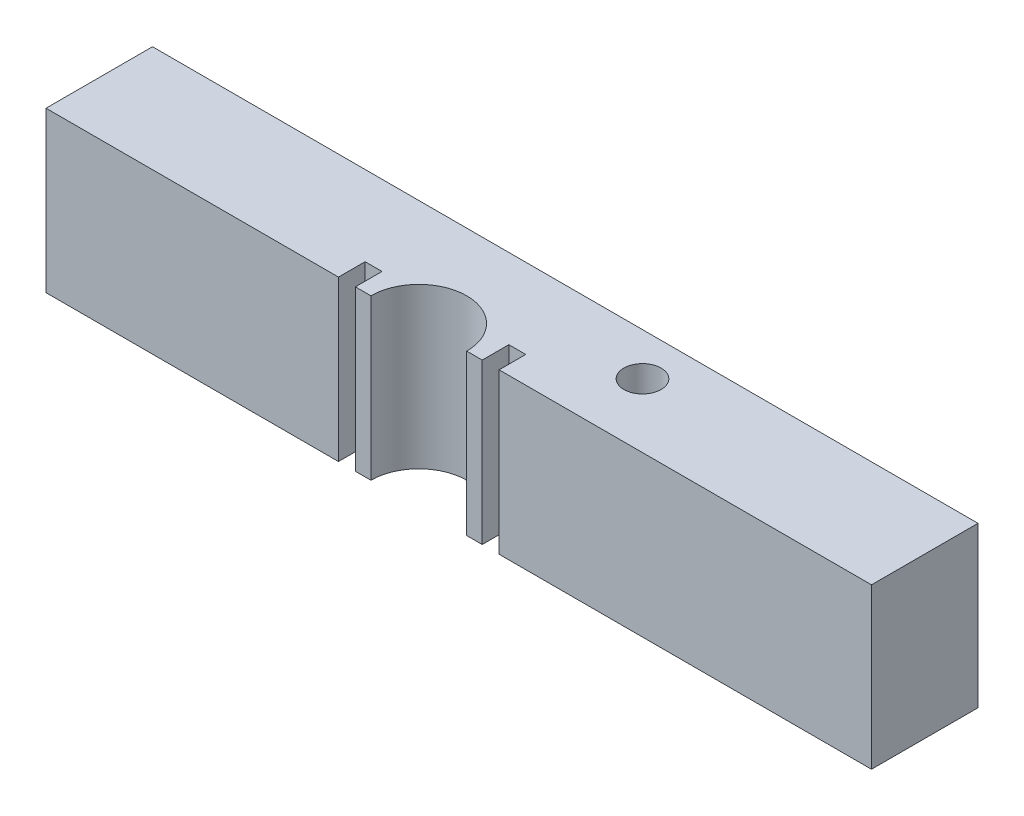
ISO-10303-21;
HEADER;
FILE_DESCRIPTION(('STEP AP214'),'2;1');
FILE_NAME('part.step','',(''),(''),'','','');
FILE_SCHEMA(('AUTOMOTIVE_DESIGN { 1 0 10303 214 1 1 1 1 }'));
ENDSEC;
DATA;
#1=APPLICATION_CONTEXT('core data for automotive mechanical design processes');
#2=APPLICATION_PROTOCOL_DEFINITION('international standard','automotive_design',2000,#1);
#3=PRODUCT_CONTEXT('',#1,'mechanical');
#4=PRODUCT('Part','Part','',(#3));
#5=PRODUCT_RELATED_PRODUCT_CATEGORY('part','',(#4));
#6=PRODUCT_DEFINITION_FORMATION('','',#4);
#7=PRODUCT_DEFINITION_CONTEXT('part definition',#1,'design');
#8=PRODUCT_DEFINITION('design','',#6,#7);
#9=PRODUCT_DEFINITION_SHAPE('','',#8);
#10=(LENGTH_UNIT() NAMED_UNIT(*) SI_UNIT(.MILLI.,.METRE.));
#11=(NAMED_UNIT(*) PLANE_ANGLE_UNIT() SI_UNIT($,.RADIAN.));
#12=(NAMED_UNIT(*) SI_UNIT($,.STERADIAN.) SOLID_ANGLE_UNIT());
#13=UNCERTAINTY_MEASURE_WITH_UNIT(LENGTH_MEASURE(1.E-05),#10,'distance_accuracy_value','');
#14=(GEOMETRIC_REPRESENTATION_CONTEXT(3) GLOBAL_UNCERTAINTY_ASSIGNED_CONTEXT((#13)) GLOBAL_UNIT_ASSIGNED_CONTEXT((#10,
#11,#12)) REPRESENTATION_CONTEXT('',''));
#15=CARTESIAN_POINT('',(0.,0.,0.));
#16=DIRECTION('',(0.,0.,1.));
#17=DIRECTION('',(1.,0.,0.));
#18=AXIS2_PLACEMENT_3D('',#15,#16,#17);
#19=CARTESIAN_POINT('',(0.,30.,0.));
#20=DIRECTION('',(0.,1.,0.));
#21=DIRECTION('',(0.,0.,1.));
#22=AXIS2_PLACEMENT_3D('',#19,#20,#21);
#23=PLANE('',#22);
#24=CARTESIAN_POINT('',(30.,30.,-12.));
#25=DIRECTION('',(0.,-1.,0.));
#26=DIRECTION('',(0.,0.,-1.));
#27=AXIS2_PLACEMENT_3D('',#24,#25,#26);
#28=CIRCLE('',#27,3.5);
#29=CARTESIAN_POINT('',(30.,30.,-15.5));
#30=VERTEX_POINT('',#29);
#31=EDGE_CURVE('E155',#30,#30,#28,.T.);
#32=ORIENTED_EDGE('',*,*,#31,.T.);
#33=EDGE_LOOP('',(#32));
#34=FACE_BOUND('',#33,.T.);
#35=DIRECTION('',(0.,0.,1.));
#36=VECTOR('',#35,1.);
#37=CARTESIAN_POINT('',(-70.,30.,-20.));
#38=LINE('',#37,#36);
#39=CARTESIAN_POINT('',(-70.,30.,-20.));
#40=VERTEX_POINT('',#39);
#41=CARTESIAN_POINT('',(-70.,30.,0.));
#42=VERTEX_POINT('',#41);
#43=EDGE_CURVE('E190',#40,#42,#38,.T.);
#44=ORIENTED_EDGE('',*,*,#43,.T.);
#45=DIRECTION('',(-1.,0.,0.));
#46=VECTOR('',#45,1.);
#47=CARTESIAN_POINT('',(85.,30.,0.));
#48=LINE('',#47,#46);
#49=CARTESIAN_POINT('',(-15.08125,30.,0.));
#50=VERTEX_POINT('',#49);
#51=EDGE_CURVE('E148',#50,#42,#48,.T.);
#52=ORIENTED_EDGE('',*,*,#51,.F.);
#53=DIRECTION('',(0.,0.,1.));
#54=VECTOR('',#53,1.);
#55=CARTESIAN_POINT('',(-15.08125,30.,0.));
#56=LINE('',#55,#54);
#57=CARTESIAN_POINT('',(-15.08125,30.,-5.));
#58=VERTEX_POINT('',#57);
#59=EDGE_CURVE('E244',#58,#50,#56,.T.);
#60=ORIENTED_EDGE('',*,*,#59,.F.);
#61=DIRECTION('',(-1.,0.,0.));
#62=VECTOR('',#61,1.);
#63=CARTESIAN_POINT('',(0.,30.,-4.99999999999999));
#64=LINE('',#63,#62);
#65=CARTESIAN_POINT('',(-11.90625,30.,-5.));
#66=VERTEX_POINT('',#65);
#67=EDGE_CURVE('E236',#66,#58,#64,.T.);
#68=ORIENTED_EDGE('',*,*,#67,.F.);
#69=DIRECTION('',(0.,0.,1.));
#70=VECTOR('',#69,1.);
#71=CARTESIAN_POINT('',(-11.90625,30.,0.));
#72=LINE('',#71,#70);
#73=CARTESIAN_POINT('',(-11.90625,30.,0.));
#74=VERTEX_POINT('',#73);
#75=EDGE_CURVE('E248',#66,#74,#72,.T.);
#76=ORIENTED_EDGE('',*,*,#75,.T.);
#77=CARTESIAN_POINT('',(-8.99999999999999,30.,0.));
#78=VERTEX_POINT('',#77);
#79=EDGE_CURVE('E210',#78,#74,#48,.T.);
#80=ORIENTED_EDGE('',*,*,#79,.F.);
#81=CARTESIAN_POINT('',(0.,30.,0.));
#82=DIRECTION('',(0.,1.,0.));
#83=DIRECTION('',(0.,0.,1.));
#84=AXIS2_PLACEMENT_3D('',#81,#82,#83);
#85=CIRCLE('',#84,9.);
#86=CARTESIAN_POINT('',(8.99999999999999,30.,0.));
#87=VERTEX_POINT('',#86);
#88=EDGE_CURVE('E175',#87,#78,#85,.T.);
#89=ORIENTED_EDGE('',*,*,#88,.F.);
#90=CARTESIAN_POINT('',(11.90625,30.,0.));
#91=VERTEX_POINT('',#90);
#92=EDGE_CURVE('E215',#91,#87,#48,.T.);
#93=ORIENTED_EDGE('',*,*,#92,.F.);
#94=DIRECTION('',(0.,0.,1.));
#95=VECTOR('',#94,1.);
#96=CARTESIAN_POINT('',(11.90625,30.,0.));
#97=LINE('',#96,#95);
#98=CARTESIAN_POINT('',(11.90625,30.,-5.));
#99=VERTEX_POINT('',#98);
#100=EDGE_CURVE('E232',#99,#91,#97,.T.);
#101=ORIENTED_EDGE('',*,*,#100,.F.);
#102=DIRECTION('',(1.,0.,0.));
#103=VECTOR('',#102,1.);
#104=CARTESIAN_POINT('',(0.,30.,-5.00000000000002));
#105=LINE('',#104,#103);
#106=CARTESIAN_POINT('',(15.08125,30.,-5.));
#107=VERTEX_POINT('',#106);
#108=EDGE_CURVE('E266',#99,#107,#105,.T.);
#109=ORIENTED_EDGE('',*,*,#108,.T.);
#110=DIRECTION('',(0.,0.,1.));
#111=VECTOR('',#110,1.);
#112=CARTESIAN_POINT('',(15.08125,30.,0.));
#113=LINE('',#112,#111);
#114=CARTESIAN_POINT('',(15.08125,30.,0.));
#115=VERTEX_POINT('',#114);
#116=EDGE_CURVE('E276',#107,#115,#113,.T.);
#117=ORIENTED_EDGE('',*,*,#116,.T.);
#118=CARTESIAN_POINT('',(85.,30.,0.));
#119=VERTEX_POINT('',#118);
#120=EDGE_CURVE('E65',#119,#115,#48,.T.);
#121=ORIENTED_EDGE('',*,*,#120,.F.);
#122=DIRECTION('',(0.,0.,-1.));
#123=VECTOR('',#122,1.);
#124=CARTESIAN_POINT('',(85.,30.,-20.));
#125=LINE('',#124,#123);
#126=CARTESIAN_POINT('',(85.,30.,-20.));
#127=VERTEX_POINT('',#126);
#128=EDGE_CURVE('E206',#119,#127,#125,.T.);
#129=ORIENTED_EDGE('',*,*,#128,.T.);
#130=DIRECTION('',(-1.,0.,0.));
#131=VECTOR('',#130,1.);
#132=CARTESIAN_POINT('',(-70.,30.,-20.));
#133=LINE('',#132,#131);
#134=EDGE_CURVE('E185',#127,#40,#133,.T.);
#135=ORIENTED_EDGE('',*,*,#134,.T.);
#136=EDGE_LOOP('',(#44,#52,#60,#68,#76,#80,#89,#93,#101,#109,#117,#121,#129,#135));
#137=FACE_BOUND('',#136,.T.);
#138=ADVANCED_FACE('F41',(#34,#137),#23,.T.);
#139=CARTESIAN_POINT('',(0.,0.,0.));
#140=DIRECTION('',(0.,1.,0.));
#141=DIRECTION('',(0.,0.,1.));
#142=AXIS2_PLACEMENT_3D('',#139,#140,#141);
#143=PLANE('',#142);
#144=CARTESIAN_POINT('',(30.,0.,-12.));
#145=DIRECTION('',(0.,-1.,0.));
#146=DIRECTION('',(0.,0.,-1.));
#147=AXIS2_PLACEMENT_3D('',#144,#145,#146);
#148=CIRCLE('',#147,3.5);
#149=CARTESIAN_POINT('',(30.,0.,-15.5));
#150=VERTEX_POINT('',#149);
#151=EDGE_CURVE('E439',#150,#150,#148,.T.);
#152=ORIENTED_EDGE('',*,*,#151,.F.);
#153=EDGE_LOOP('',(#152));
#154=FACE_BOUND('',#153,.T.);
#155=DIRECTION('',(1.,0.,0.));
#156=VECTOR('',#155,1.);
#157=CARTESIAN_POINT('',(-70.,0.,0.));
#158=LINE('',#157,#156);
#159=CARTESIAN_POINT('',(-70.,0.,0.));
#160=VERTEX_POINT('',#159);
#161=CARTESIAN_POINT('',(-15.08125,0.,0.));
#162=VERTEX_POINT('',#161);
#163=EDGE_CURVE('E145',#160,#162,#158,.T.);
#164=ORIENTED_EDGE('',*,*,#163,.F.);
#165=DIRECTION('',(0.,0.,1.));
#166=VECTOR('',#165,1.);
#167=CARTESIAN_POINT('',(-70.,0.,-20.));
#168=LINE('',#167,#166);
#169=CARTESIAN_POINT('',(-70.,0.,-20.));
#170=VERTEX_POINT('',#169);
#171=EDGE_CURVE('E162',#170,#160,#168,.T.);
#172=ORIENTED_EDGE('',*,*,#171,.F.);
#173=DIRECTION('',(-1.,0.,0.));
#174=VECTOR('',#173,1.);
#175=CARTESIAN_POINT('',(-70.,0.,-20.));
#176=LINE('',#175,#174);
#177=CARTESIAN_POINT('',(85.,0.,-20.));
#178=VERTEX_POINT('',#177);
#179=EDGE_CURVE('E179',#178,#170,#176,.T.);
#180=ORIENTED_EDGE('',*,*,#179,.F.);
#181=DIRECTION('',(0.,0.,-1.));
#182=VECTOR('',#181,1.);
#183=CARTESIAN_POINT('',(85.,0.,-20.));
#184=LINE('',#183,#182);
#185=CARTESIAN_POINT('',(85.,0.,0.));
#186=VERTEX_POINT('',#185);
#187=EDGE_CURVE('E174',#186,#178,#184,.T.);
#188=ORIENTED_EDGE('',*,*,#187,.F.);
#189=CARTESIAN_POINT('',(15.08125,0.,0.));
#190=VERTEX_POINT('',#189);
#191=EDGE_CURVE('E154',#190,#186,#158,.T.);
#192=ORIENTED_EDGE('',*,*,#191,.F.);
#193=DIRECTION('',(0.,0.,1.));
#194=VECTOR('',#193,1.);
#195=CARTESIAN_POINT('',(15.08125,0.,0.));
#196=LINE('',#195,#194);
#197=CARTESIAN_POINT('',(15.08125,0.,-5.));
#198=VERTEX_POINT('',#197);
#199=EDGE_CURVE('E265',#198,#190,#196,.T.);
#200=ORIENTED_EDGE('',*,*,#199,.F.);
#201=DIRECTION('',(1.,0.,0.));
#202=VECTOR('',#201,1.);
#203=CARTESIAN_POINT('',(0.,0.,-5.00000000000002));
#204=LINE('',#203,#202);
#205=CARTESIAN_POINT('',(11.90625,0.,-5.));
#206=VERTEX_POINT('',#205);
#207=EDGE_CURVE('E269',#206,#198,#204,.T.);
#208=ORIENTED_EDGE('',*,*,#207,.F.);
#209=DIRECTION('',(0.,0.,1.));
#210=VECTOR('',#209,1.);
#211=CARTESIAN_POINT('',(11.90625,0.,0.));
#212=LINE('',#211,#210);
#213=CARTESIAN_POINT('',(11.90625,0.,0.));
#214=VERTEX_POINT('',#213);
#215=EDGE_CURVE('E261',#206,#214,#212,.T.);
#216=ORIENTED_EDGE('',*,*,#215,.T.);
#217=CARTESIAN_POINT('',(8.99999999999999,0.,0.));
#218=VERTEX_POINT('',#217);
#219=EDGE_CURVE('E57',#218,#214,#158,.T.);
#220=ORIENTED_EDGE('',*,*,#219,.F.);
#221=CARTESIAN_POINT('',(0.,0.,0.));
#222=DIRECTION('',(0.,1.,0.));
#223=DIRECTION('',(0.,0.,1.));
#224=AXIS2_PLACEMENT_3D('',#221,#222,#223);
#225=CIRCLE('',#224,9.);
#226=CARTESIAN_POINT('',(-8.99999999999999,0.,0.));
#227=VERTEX_POINT('',#226);
#228=EDGE_CURVE('E182',#218,#227,#225,.T.);
#229=ORIENTED_EDGE('',*,*,#228,.T.);
#230=CARTESIAN_POINT('',(-11.90625,0.,0.));
#231=VERTEX_POINT('',#230);
#232=EDGE_CURVE('E168',#231,#227,#158,.T.);
#233=ORIENTED_EDGE('',*,*,#232,.F.);
#234=DIRECTION('',(0.,0.,1.));
#235=VECTOR('',#234,1.);
#236=CARTESIAN_POINT('',(-11.90625,0.,0.));
#237=LINE('',#236,#235);
#238=CARTESIAN_POINT('',(-11.90625,0.,-5.));
#239=VERTEX_POINT('',#238);
#240=EDGE_CURVE('E235',#239,#231,#237,.T.);
#241=ORIENTED_EDGE('',*,*,#240,.F.);
#242=DIRECTION('',(-1.,0.,0.));
#243=VECTOR('',#242,1.);
#244=CARTESIAN_POINT('',(0.,0.,-4.99999999999999));
#245=LINE('',#244,#243);
#246=CARTESIAN_POINT('',(-15.08125,0.,-5.));
#247=VERTEX_POINT('',#246);
#248=EDGE_CURVE('E240',#239,#247,#245,.T.);
#249=ORIENTED_EDGE('',*,*,#248,.T.);
#250=DIRECTION('',(0.,0.,1.));
#251=VECTOR('',#250,1.);
#252=CARTESIAN_POINT('',(-15.08125,0.,0.));
#253=LINE('',#252,#251);
#254=EDGE_CURVE('E165',#247,#162,#253,.T.);
#255=ORIENTED_EDGE('',*,*,#254,.T.);
#256=EDGE_LOOP('',(#164,#172,#180,#188,#192,#200,#208,#216,#220,#229,#233,#241,#249,#255));
#257=FACE_BOUND('',#256,.T.);
#258=ADVANCED_FACE('F160',(#154,#257),#143,.F.);
#259=CARTESIAN_POINT('',(-70.,30.,-20.));
#260=DIRECTION('',(1.,0.,0.));
#261=DIRECTION('',(0.,0.,-1.));
#262=AXIS2_PLACEMENT_3D('',#259,#260,#261);
#263=PLANE('',#262);
#264=DIRECTION('',(0.,-1.,0.));
#265=VECTOR('',#264,1.);
#266=CARTESIAN_POINT('',(-70.,30.,0.));
#267=LINE('',#266,#265);
#268=EDGE_CURVE('E142',#42,#160,#267,.T.);
#269=ORIENTED_EDGE('',*,*,#268,.F.);
#270=ORIENTED_EDGE('',*,*,#43,.F.);
#271=DIRECTION('',(0.,-1.,0.));
#272=VECTOR('',#271,1.);
#273=CARTESIAN_POINT('',(-70.,30.,-20.));
#274=LINE('',#273,#272);
#275=EDGE_CURVE('E172',#40,#170,#274,.T.);
#276=ORIENTED_EDGE('',*,*,#275,.T.);
#277=ORIENTED_EDGE('',*,*,#171,.T.);
#278=EDGE_LOOP('',(#269,#270,#276,#277));
#279=FACE_BOUND('',#278,.T.);
#280=ADVANCED_FACE('F43',(#279),#263,.F.);
#281=CARTESIAN_POINT('',(85.,30.,-20.));
#282=DIRECTION('',(-1.,0.,0.));
#283=DIRECTION('',(0.,0.,1.));
#284=AXIS2_PLACEMENT_3D('',#281,#282,#283);
#285=PLANE('',#284);
#286=DIRECTION('',(0.,1.,0.));
#287=VECTOR('',#286,1.);
#288=CARTESIAN_POINT('',(85.,0.,0.));
#289=LINE('',#288,#287);
#290=EDGE_CURVE('E167',#186,#119,#289,.T.);
#291=ORIENTED_EDGE('',*,*,#290,.F.);
#292=ORIENTED_EDGE('',*,*,#187,.T.);
#293=DIRECTION('',(0.,-1.,0.));
#294=VECTOR('',#293,1.);
#295=CARTESIAN_POINT('',(85.,30.,-20.));
#296=LINE('',#295,#294);
#297=EDGE_CURVE('E50',#127,#178,#296,.T.);
#298=ORIENTED_EDGE('',*,*,#297,.F.);
#299=ORIENTED_EDGE('',*,*,#128,.F.);
#300=EDGE_LOOP('',(#291,#292,#298,#299));
#301=FACE_BOUND('',#300,.T.);
#302=ADVANCED_FACE('F205',(#301),#285,.F.);
#303=CARTESIAN_POINT('',(0.,30.,0.));
#304=DIRECTION('',(0.,-1.,0.));
#305=DIRECTION('',(0.,0.,-1.));
#306=AXIS2_PLACEMENT_3D('',#303,#304,#305);
#307=CYLINDRICAL_SURFACE('',#306,9.);
#308=ORIENTED_EDGE('',*,*,#88,.T.);
#309=DIRECTION('',(0.,-1.,0.));
#310=VECTOR('',#309,1.);
#311=CARTESIAN_POINT('',(-9.,30.,0.));
#312=LINE('',#311,#310);
#313=EDGE_CURVE('E228',#78,#227,#312,.T.);
#314=ORIENTED_EDGE('',*,*,#313,.T.);
#315=ORIENTED_EDGE('',*,*,#228,.F.);
#316=DIRECTION('',(0.,-1.,0.));
#317=VECTOR('',#316,1.);
#318=CARTESIAN_POINT('',(9.,30.,0.));
#319=LINE('',#318,#317);
#320=EDGE_CURVE('E224',#218,#87,#319,.F.);
#321=ORIENTED_EDGE('',*,*,#320,.T.);
#322=EDGE_LOOP('',(#308,#314,#315,#321));
#323=FACE_BOUND('',#322,.T.);
#324=ADVANCED_FACE('F332',(#323),#307,.F.);
#325=CARTESIAN_POINT('',(11.90625,0.,0.));
#326=DIRECTION('',(-1.,0.,0.));
#327=DIRECTION('',(0.,0.,1.));
#328=AXIS2_PLACEMENT_3D('',#325,#326,#327);
#329=PLANE('',#328);
#330=DIRECTION('',(0.,1.,0.));
#331=VECTOR('',#330,1.);
#332=CARTESIAN_POINT('',(11.90625,0.,0.));
#333=LINE('',#332,#331);
#334=EDGE_CURVE('E221',#214,#91,#333,.T.);
#335=ORIENTED_EDGE('',*,*,#334,.F.);
#336=ORIENTED_EDGE('',*,*,#215,.F.);
#337=DIRECTION('',(0.,1.,0.));
#338=VECTOR('',#337,1.);
#339=CARTESIAN_POINT('',(11.90625,0.,-5.));
#340=LINE('',#339,#338);
#341=EDGE_CURVE('E249',#206,#99,#340,.T.);
#342=ORIENTED_EDGE('',*,*,#341,.T.);
#343=ORIENTED_EDGE('',*,*,#100,.T.);
#344=EDGE_LOOP('',(#335,#336,#342,#343));
#345=FACE_BOUND('',#344,.T.);
#346=ADVANCED_FACE('F327',(#345),#329,.F.);
#347=CARTESIAN_POINT('',(15.08125,0.,0.));
#348=DIRECTION('',(-1.,0.,0.));
#349=DIRECTION('',(0.,0.,1.));
#350=AXIS2_PLACEMENT_3D('',#347,#348,#349);
#351=PLANE('',#350);
#352=ORIENTED_EDGE('',*,*,#199,.T.);
#353=DIRECTION('',(0.,1.,0.));
#354=VECTOR('',#353,1.);
#355=CARTESIAN_POINT('',(15.08125,0.,0.));
#356=LINE('',#355,#354);
#357=EDGE_CURVE('E218',#190,#115,#356,.T.);
#358=ORIENTED_EDGE('',*,*,#357,.T.);
#359=ORIENTED_EDGE('',*,*,#116,.F.);
#360=DIRECTION('',(0.,1.,0.));
#361=VECTOR('',#360,1.);
#362=CARTESIAN_POINT('',(15.08125,0.,-5.));
#363=LINE('',#362,#361);
#364=EDGE_CURVE('E272',#198,#107,#363,.T.);
#365=ORIENTED_EDGE('',*,*,#364,.F.);
#366=EDGE_LOOP('',(#352,#358,#359,#365));
#367=FACE_BOUND('',#366,.T.);
#368=ADVANCED_FACE('F317',(#367),#351,.T.);
#369=CARTESIAN_POINT('',(-15.08125,0.,0.));
#370=DIRECTION('',(-1.,0.,0.));
#371=DIRECTION('',(0.,0.,1.));
#372=AXIS2_PLACEMENT_3D('',#369,#370,#371);
#373=PLANE('',#372);
#374=DIRECTION('',(0.,1.,0.));
#375=VECTOR('',#374,1.);
#376=CARTESIAN_POINT('',(-15.08125,0.,0.));
#377=LINE('',#376,#375);
#378=EDGE_CURVE('E214',#162,#50,#377,.T.);
#379=ORIENTED_EDGE('',*,*,#378,.F.);
#380=ORIENTED_EDGE('',*,*,#254,.F.);
#381=DIRECTION('',(0.,1.,0.));
#382=VECTOR('',#381,1.);
#383=CARTESIAN_POINT('',(-15.08125,0.,-5.));
#384=LINE('',#383,#382);
#385=EDGE_CURVE('E256',#247,#58,#384,.T.);
#386=ORIENTED_EDGE('',*,*,#385,.T.);
#387=ORIENTED_EDGE('',*,*,#59,.T.);
#388=EDGE_LOOP('',(#379,#380,#386,#387));
#389=FACE_BOUND('',#388,.T.);
#390=ADVANCED_FACE('F297',(#389),#373,.F.);
#391=CARTESIAN_POINT('',(-11.90625,0.,0.));
#392=DIRECTION('',(-1.,0.,0.));
#393=DIRECTION('',(0.,0.,1.));
#394=AXIS2_PLACEMENT_3D('',#391,#392,#393);
#395=PLANE('',#394);
#396=ORIENTED_EDGE('',*,*,#240,.T.);
#397=DIRECTION('',(0.,1.,0.));
#398=VECTOR('',#397,1.);
#399=CARTESIAN_POINT('',(-11.90625,0.,0.));
#400=LINE('',#399,#398);
#401=EDGE_CURVE('E11',#231,#74,#400,.T.);
#402=ORIENTED_EDGE('',*,*,#401,.T.);
#403=ORIENTED_EDGE('',*,*,#75,.F.);
#404=DIRECTION('',(0.,1.,0.));
#405=VECTOR('',#404,1.);
#406=CARTESIAN_POINT('',(-11.90625,0.,-5.));
#407=LINE('',#406,#405);
#408=EDGE_CURVE('E243',#239,#66,#407,.T.);
#409=ORIENTED_EDGE('',*,*,#408,.F.);
#410=EDGE_LOOP('',(#396,#402,#403,#409));
#411=FACE_BOUND('',#410,.T.);
#412=ADVANCED_FACE('F305',(#411),#395,.T.);
#413=CARTESIAN_POINT('',(-70.,30.,-20.));
#414=DIRECTION('',(0.,0.,1.));
#415=DIRECTION('',(1.,0.,0.));
#416=AXIS2_PLACEMENT_3D('',#413,#414,#415);
#417=PLANE('',#416);
#418=ORIENTED_EDGE('',*,*,#179,.T.);
#419=ORIENTED_EDGE('',*,*,#275,.F.);
#420=ORIENTED_EDGE('',*,*,#134,.F.);
#421=ORIENTED_EDGE('',*,*,#297,.T.);
#422=EDGE_LOOP('',(#418,#419,#420,#421));
#423=FACE_BOUND('',#422,.T.);
#424=ADVANCED_FACE('F197',(#423),#417,.F.);
#425=CARTESIAN_POINT('',(0.,0.,-5.00000000000002));
#426=DIRECTION('',(0.,0.,1.));
#427=DIRECTION('',(1.,0.,0.));
#428=AXIS2_PLACEMENT_3D('',#425,#426,#427);
#429=PLANE('',#428);
#430=ORIENTED_EDGE('',*,*,#108,.F.);
#431=ORIENTED_EDGE('',*,*,#341,.F.);
#432=ORIENTED_EDGE('',*,*,#207,.T.);
#433=ORIENTED_EDGE('',*,*,#364,.T.);
#434=EDGE_LOOP('',(#430,#431,#432,#433));
#435=FACE_BOUND('',#434,.T.);
#436=ADVANCED_FACE('F323',(#435),#429,.T.);
#437=CARTESIAN_POINT('',(0.,0.,-4.99999999999999));
#438=DIRECTION('',(0.,0.,-1.));
#439=DIRECTION('',(-1.,0.,0.));
#440=AXIS2_PLACEMENT_3D('',#437,#438,#439);
#441=PLANE('',#440);
#442=ORIENTED_EDGE('',*,*,#67,.T.);
#443=ORIENTED_EDGE('',*,*,#385,.F.);
#444=ORIENTED_EDGE('',*,*,#248,.F.);
#445=ORIENTED_EDGE('',*,*,#408,.T.);
#446=EDGE_LOOP('',(#442,#443,#444,#445));
#447=FACE_BOUND('',#446,.T.);
#448=ADVANCED_FACE('F300',(#447),#441,.F.);
#449=CARTESIAN_POINT('',(0.,0.,0.));
#450=DIRECTION('',(0.,0.,1.));
#451=DIRECTION('',(1.,0.,0.));
#452=AXIS2_PLACEMENT_3D('',#449,#450,#451);
#453=PLANE('',#452);
#454=ORIENTED_EDGE('',*,*,#79,.T.);
#455=ORIENTED_EDGE('',*,*,#401,.F.);
#456=ORIENTED_EDGE('',*,*,#232,.T.);
#457=ORIENTED_EDGE('',*,*,#313,.F.);
#458=EDGE_LOOP('',(#454,#455,#456,#457));
#459=FACE_BOUND('',#458,.T.);
#460=ADVANCED_FACE('F309',(#459),#453,.T.);
#461=ORIENTED_EDGE('',*,*,#378,.T.);
#462=ORIENTED_EDGE('',*,*,#51,.T.);
#463=ORIENTED_EDGE('',*,*,#268,.T.);
#464=ORIENTED_EDGE('',*,*,#163,.T.);
#465=EDGE_LOOP('',(#461,#462,#463,#464));
#466=FACE_BOUND('',#465,.T.);
#467=ADVANCED_FACE('F144',(#466),#453,.T.);
#468=ORIENTED_EDGE('',*,*,#191,.T.);
#469=ORIENTED_EDGE('',*,*,#290,.T.);
#470=ORIENTED_EDGE('',*,*,#120,.T.);
#471=ORIENTED_EDGE('',*,*,#357,.F.);
#472=EDGE_LOOP('',(#468,#469,#470,#471));
#473=FACE_BOUND('',#472,.T.);
#474=ADVANCED_FACE('F314',(#473),#453,.T.);
#475=ORIENTED_EDGE('',*,*,#219,.T.);
#476=ORIENTED_EDGE('',*,*,#334,.T.);
#477=ORIENTED_EDGE('',*,*,#92,.T.);
#478=ORIENTED_EDGE('',*,*,#320,.F.);
#479=EDGE_LOOP('',(#475,#476,#477,#478));
#480=FACE_BOUND('',#479,.T.);
#481=ADVANCED_FACE('F328',(#480),#453,.T.);
#482=CARTESIAN_POINT('',(30.,30.,-12.));
#483=DIRECTION('',(0.,-1.,0.));
#484=DIRECTION('',(0.,0.,-1.));
#485=AXIS2_PLACEMENT_3D('',#482,#483,#484);
#486=CYLINDRICAL_SURFACE('',#485,3.5);
#487=ORIENTED_EDGE('',*,*,#31,.F.);
#488=EDGE_LOOP('',(#487));
#489=FACE_BOUND('',#488,.T.);
#490=ORIENTED_EDGE('',*,*,#151,.T.);
#491=EDGE_LOOP('',(#490));
#492=FACE_BOUND('',#491,.T.);
#493=ADVANCED_FACE('F409',(#489,#492),#486,.F.);
#494=CLOSED_SHELL('',(#138,#258,#280,#302,#324,#346,#368,#390,#412,#424,#436,#448,#460,#467,
#474,#481,#493));
#495=MANIFOLD_SOLID_BREP('B2',#494);
#496=ADVANCED_BREP_SHAPE_REPRESENTATION('',(#18,#495),#14);
#497=SHAPE_DEFINITION_REPRESENTATION(#9,#496);
ENDSEC;
END-ISO-10303-21;
